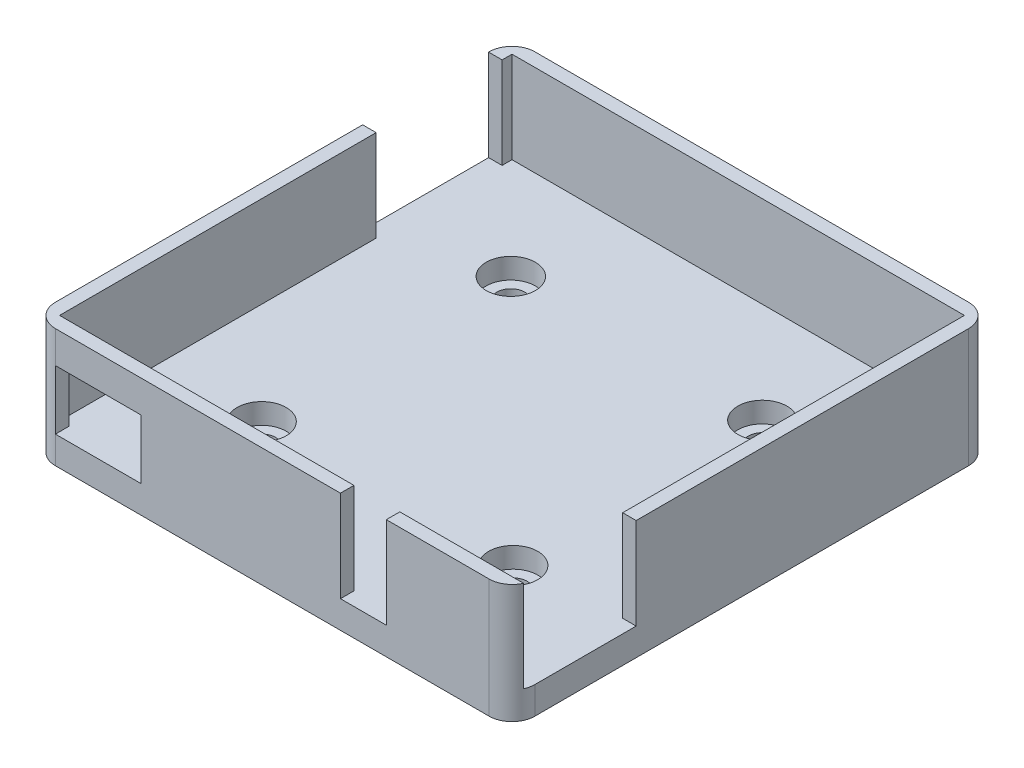
ISO-10303-21;
HEADER;
FILE_DESCRIPTION(('STEP AP214'),'2;1');
FILE_NAME('part.step','',(''),(''),'','','');
FILE_SCHEMA(('AUTOMOTIVE_DESIGN { 1 0 10303 214 1 1 1 1 }'));
ENDSEC;
DATA;
#1=APPLICATION_CONTEXT('core data for automotive mechanical design processes');
#2=APPLICATION_PROTOCOL_DEFINITION('international standard','automotive_design',2000,#1);
#3=PRODUCT_CONTEXT('',#1,'mechanical');
#4=PRODUCT('Part','Part','',(#3));
#5=PRODUCT_RELATED_PRODUCT_CATEGORY('part','',(#4));
#6=PRODUCT_DEFINITION_FORMATION('','',#4);
#7=PRODUCT_DEFINITION_CONTEXT('part definition',#1,'design');
#8=PRODUCT_DEFINITION('design','',#6,#7);
#9=PRODUCT_DEFINITION_SHAPE('','',#8);
#10=(LENGTH_UNIT() NAMED_UNIT(*) SI_UNIT(.MILLI.,.METRE.));
#11=(NAMED_UNIT(*) PLANE_ANGLE_UNIT() SI_UNIT($,.RADIAN.));
#12=(NAMED_UNIT(*) SI_UNIT($,.STERADIAN.) SOLID_ANGLE_UNIT());
#13=UNCERTAINTY_MEASURE_WITH_UNIT(LENGTH_MEASURE(1.E-05),#10,'distance_accuracy_value','');
#14=(GEOMETRIC_REPRESENTATION_CONTEXT(3) GLOBAL_UNCERTAINTY_ASSIGNED_CONTEXT((#13)) GLOBAL_UNIT_ASSIGNED_CONTEXT((#10,
#11,#12)) REPRESENTATION_CONTEXT('',''));
#15=CARTESIAN_POINT('',(0.,0.,0.));
#16=DIRECTION('',(0.,0.,1.));
#17=DIRECTION('',(1.,0.,0.));
#18=AXIS2_PLACEMENT_3D('',#15,#16,#17);
#19=CARTESIAN_POINT('',(0.,11.43,0.));
#20=DIRECTION('',(0.,-1.,0.));
#21=DIRECTION('',(0.,0.,-1.));
#22=AXIS2_PLACEMENT_3D('',#19,#20,#21);
#23=PLANE('',#22);
#24=DIRECTION('',(1.,0.,0.));
#25=VECTOR('',#24,1.);
#26=CARTESIAN_POINT('',(-26.646,11.43,26.646));
#27=LINE('',#26,#25);
#28=CARTESIAN_POINT('',(12.676,11.43,26.646));
#29=VERTEX_POINT('',#28);
#30=CARTESIAN_POINT('',(24.106,11.43,26.646));
#31=VERTEX_POINT('',#30);
#32=EDGE_CURVE('E346',#29,#31,#27,.T.);
#33=ORIENTED_EDGE('',*,*,#32,.T.);
#34=CARTESIAN_POINT('',(24.106,11.43,24.106));
#35=DIRECTION('',(0.,-1.,0.));
#36=DIRECTION('',(0.,0.,-1.));
#37=AXIS2_PLACEMENT_3D('',#34,#35,#36);
#38=CIRCLE('',#37,2.54);
#39=CARTESIAN_POINT('',(26.4233260452513,11.43,25.146));
#40=VERTEX_POINT('',#39);
#41=EDGE_CURVE('E55',#31,#40,#38,.F.);
#42=ORIENTED_EDGE('',*,*,#41,.T.);
#43=DIRECTION('',(1.,0.,0.));
#44=VECTOR('',#43,1.);
#45=CARTESIAN_POINT('',(-25.146,11.43,25.146));
#46=LINE('',#45,#44);
#47=CARTESIAN_POINT('',(12.676,11.43,25.146));
#48=VERTEX_POINT('',#47);
#49=EDGE_CURVE('E329',#48,#40,#46,.T.);
#50=ORIENTED_EDGE('',*,*,#49,.F.);
#51=DIRECTION('',(0.,0.,1.));
#52=VECTOR('',#51,1.);
#53=CARTESIAN_POINT('',(12.676,11.43,16.646));
#54=LINE('',#53,#52);
#55=EDGE_CURVE('E298',#48,#29,#54,.T.);
#56=ORIENTED_EDGE('',*,*,#55,.T.);
#57=EDGE_LOOP('',(#33,#42,#50,#56));
#58=FACE_BOUND('',#57,.T.);
#59=ADVANCED_FACE('F33',(#58),#23,.F.);
#60=DIRECTION('',(0.,0.,1.));
#61=VECTOR('',#60,1.);
#62=CARTESIAN_POINT('',(-26.646,11.43,-26.646));
#63=LINE('',#62,#61);
#64=CARTESIAN_POINT('',(-26.646,11.43,-10.04600006));
#65=VERTEX_POINT('',#64);
#66=CARTESIAN_POINT('',(-26.646,11.43,24.106));
#67=VERTEX_POINT('',#66);
#68=EDGE_CURVE('E343',#65,#67,#63,.T.);
#69=ORIENTED_EDGE('',*,*,#68,.T.);
#70=CARTESIAN_POINT('',(-24.106,11.43,24.106));
#71=DIRECTION('',(0.,-1.,0.));
#72=DIRECTION('',(0.,0.,-1.));
#73=AXIS2_PLACEMENT_3D('',#70,#71,#72);
#74=CIRCLE('',#73,2.54);
#75=CARTESIAN_POINT('',(-24.106,11.43,26.646));
#76=VERTEX_POINT('',#75);
#77=EDGE_CURVE('E401',#67,#76,#74,.F.);
#78=ORIENTED_EDGE('',*,*,#77,.T.);
#79=CARTESIAN_POINT('',(7.576,11.43,26.646));
#80=VERTEX_POINT('',#79);
#81=EDGE_CURVE('E347',#76,#80,#27,.T.);
#82=ORIENTED_EDGE('',*,*,#81,.T.);
#83=DIRECTION('',(0.,0.,1.));
#84=VECTOR('',#83,1.);
#85=CARTESIAN_POINT('',(7.576,11.43,16.646));
#86=LINE('',#85,#84);
#87=CARTESIAN_POINT('',(7.576,11.43,25.146));
#88=VERTEX_POINT('',#87);
#89=EDGE_CURVE('E268',#88,#80,#86,.T.);
#90=ORIENTED_EDGE('',*,*,#89,.F.);
#91=CARTESIAN_POINT('',(-25.146,11.43,25.146));
#92=VERTEX_POINT('',#91);
#93=EDGE_CURVE('E330',#92,#88,#46,.T.);
#94=ORIENTED_EDGE('',*,*,#93,.F.);
#95=DIRECTION('',(0.,0.,1.));
#96=VECTOR('',#95,1.);
#97=CARTESIAN_POINT('',(-25.146,11.43,-25.146));
#98=LINE('',#97,#96);
#99=CARTESIAN_POINT('',(-25.146,11.43,-10.04600006));
#100=VERTEX_POINT('',#99);
#101=EDGE_CURVE('E325',#100,#92,#98,.T.);
#102=ORIENTED_EDGE('',*,*,#101,.F.);
#103=DIRECTION('',(-1.,0.,0.));
#104=VECTOR('',#103,1.);
#105=CARTESIAN_POINT('',(-16.646,11.43,-10.04600006));
#106=LINE('',#105,#104);
#107=EDGE_CURVE('E316',#100,#65,#106,.T.);
#108=ORIENTED_EDGE('',*,*,#107,.T.);
#109=EDGE_LOOP('',(#69,#78,#82,#90,#94,#102,#108));
#110=FACE_BOUND('',#109,.T.);
#111=ADVANCED_FACE('F465',(#110),#23,.F.);
#112=CARTESIAN_POINT('',(-25.146,11.43,25.146));
#113=DIRECTION('',(0.,0.,-1.));
#114=DIRECTION('',(-1.,0.,0.));
#115=AXIS2_PLACEMENT_3D('',#112,#113,#114);
#116=PLANE('',#115);
#117=DIRECTION('',(0.,1.,0.));
#118=VECTOR('',#117,1.);
#119=CARTESIAN_POINT('',(-24.106,11.43,25.146));
#120=LINE('',#119,#118);
#121=CARTESIAN_POINT('',(-24.106,1.27,25.146));
#122=VERTEX_POINT('',#121);
#123=CARTESIAN_POINT('',(-24.106,7.87,25.146));
#124=VERTEX_POINT('',#123);
#125=EDGE_CURVE('E381',#122,#124,#120,.T.);
#126=ORIENTED_EDGE('',*,*,#125,.F.);
#127=DIRECTION('',(1.,0.,0.));
#128=VECTOR('',#127,1.);
#129=CARTESIAN_POINT('',(0.,1.27,25.146));
#130=LINE('',#129,#128);
#131=CARTESIAN_POINT('',(-25.146,1.27,25.146));
#132=VERTEX_POINT('',#131);
#133=EDGE_CURVE('E362',#132,#122,#130,.T.);
#134=ORIENTED_EDGE('',*,*,#133,.F.);
#135=DIRECTION('',(0.,-1.,0.));
#136=VECTOR('',#135,1.);
#137=CARTESIAN_POINT('',(-25.146,11.43,25.146));
#138=LINE('',#137,#136);
#139=EDGE_CURVE('E333',#92,#132,#138,.T.);
#140=ORIENTED_EDGE('',*,*,#139,.F.);
#141=ORIENTED_EDGE('',*,*,#93,.T.);
#142=DIRECTION('',(0.,1.,0.));
#143=VECTOR('',#142,1.);
#144=CARTESIAN_POINT('',(7.576,11.43,25.146));
#145=LINE('',#144,#143);
#146=CARTESIAN_POINT('',(7.576,1.27,25.146));
#147=VERTEX_POINT('',#146);
#148=EDGE_CURVE('E374',#147,#88,#145,.T.);
#149=ORIENTED_EDGE('',*,*,#148,.F.);
#150=CARTESIAN_POINT('',(-14.606,1.27,25.146));
#151=VERTEX_POINT('',#150);
#152=EDGE_CURVE('E366',#151,#147,#130,.T.);
#153=ORIENTED_EDGE('',*,*,#152,.F.);
#154=DIRECTION('',(0.,-1.,0.));
#155=VECTOR('',#154,1.);
#156=CARTESIAN_POINT('',(-14.606,11.43,25.146));
#157=LINE('',#156,#155);
#158=CARTESIAN_POINT('',(-14.606,7.87,25.146));
#159=VERTEX_POINT('',#158);
#160=EDGE_CURVE('E376',#159,#151,#157,.T.);
#161=ORIENTED_EDGE('',*,*,#160,.F.);
#162=DIRECTION('',(1.,0.,0.));
#163=VECTOR('',#162,1.);
#164=CARTESIAN_POINT('',(-25.146,7.87,25.146));
#165=LINE('',#164,#163);
#166=EDGE_CURVE('E379',#124,#159,#165,.T.);
#167=ORIENTED_EDGE('',*,*,#166,.F.);
#168=EDGE_LOOP('',(#126,#134,#140,#141,#149,#153,#161,#167));
#169=FACE_BOUND('',#168,.T.);
#170=ADVANCED_FACE('F470',(#169),#116,.T.);
#171=CARTESIAN_POINT('',(-25.146,11.43,-25.146));
#172=DIRECTION('',(1.,0.,0.));
#173=DIRECTION('',(0.,0.,-1.));
#174=AXIS2_PLACEMENT_3D('',#171,#172,#173);
#175=PLANE('',#174);
#176=DIRECTION('',(0.,1.,0.));
#177=VECTOR('',#176,1.);
#178=CARTESIAN_POINT('',(-25.146,11.43,-24.046));
#179=LINE('',#178,#177);
#180=CARTESIAN_POINT('',(-25.146,1.27,-24.046));
#181=VERTEX_POINT('',#180);
#182=CARTESIAN_POINT('',(-25.146,11.43,-24.046));
#183=VERTEX_POINT('',#182);
#184=EDGE_CURVE('E369',#181,#183,#179,.T.);
#185=ORIENTED_EDGE('',*,*,#184,.F.);
#186=DIRECTION('',(0.,0.,1.));
#187=VECTOR('',#186,1.);
#188=CARTESIAN_POINT('',(-25.146,1.27,0.));
#189=LINE('',#188,#187);
#190=CARTESIAN_POINT('',(-25.146,1.27,-25.146));
#191=VERTEX_POINT('',#190);
#192=EDGE_CURVE('E358',#191,#181,#189,.T.);
#193=ORIENTED_EDGE('',*,*,#192,.F.);
#194=DIRECTION('',(0.,-1.,0.));
#195=VECTOR('',#194,1.);
#196=CARTESIAN_POINT('',(-25.146,11.43,-25.146));
#197=LINE('',#196,#195);
#198=CARTESIAN_POINT('',(-25.146,11.43,-25.146));
#199=VERTEX_POINT('',#198);
#200=EDGE_CURVE('E336',#199,#191,#197,.T.);
#201=ORIENTED_EDGE('',*,*,#200,.F.);
#202=EDGE_CURVE('E326',#199,#183,#98,.T.);
#203=ORIENTED_EDGE('',*,*,#202,.T.);
#204=EDGE_LOOP('',(#185,#193,#201,#203));
#205=FACE_BOUND('',#204,.T.);
#206=ADVANCED_FACE('F441',(#205),#175,.T.);
#207=CARTESIAN_POINT('',(0.,1.27,0.));
#208=DIRECTION('',(0.,1.,0.));
#209=DIRECTION('',(0.,0.,1.));
#210=AXIS2_PLACEMENT_3D('',#207,#208,#209);
#211=PLANE('',#210);
#212=CARTESIAN_POINT('',(-13.8485202030083,1.27,13.9820178182196));
#213=DIRECTION('',(0.,1.,0.));
#214=DIRECTION('',(0.,0.,1.));
#215=AXIS2_PLACEMENT_3D('',#212,#213,#214);
#216=CIRCLE('',#215,2.73050000000001);
#217=CARTESIAN_POINT('',(-13.8485202030083,1.27,16.7125178182196));
#218=VERTEX_POINT('',#217);
#219=EDGE_CURVE('E592',#218,#218,#216,.T.);
#220=ORIENTED_EDGE('',*,*,#219,.F.);
#221=EDGE_LOOP('',(#220));
#222=FACE_BOUND('',#221,.T.);
#223=CARTESIAN_POINT('',(-13.9820178182196,1.27,-13.8485202030091));
#224=DIRECTION('',(0.,1.,0.));
#225=DIRECTION('',(0.,0.,1.));
#226=AXIS2_PLACEMENT_3D('',#223,#224,#225);
#227=CIRCLE('',#226,2.73050000000001);
#228=CARTESIAN_POINT('',(-13.9820178182196,1.27,-11.118020203009));
#229=VERTEX_POINT('',#228);
#230=EDGE_CURVE('E602',#229,#229,#227,.T.);
#231=ORIENTED_EDGE('',*,*,#230,.F.);
#232=EDGE_LOOP('',(#231));
#233=FACE_BOUND('',#232,.T.);
#234=CARTESIAN_POINT('',(13.848520203009,1.27,-13.9820178182204));
#235=DIRECTION('',(0.,1.,0.));
#236=DIRECTION('',(0.,0.,1.));
#237=AXIS2_PLACEMENT_3D('',#234,#235,#236);
#238=CIRCLE('',#237,2.73050000000001);
#239=CARTESIAN_POINT('',(13.848520203009,1.27,-11.2515178182204));
#240=VERTEX_POINT('',#239);
#241=EDGE_CURVE('E614',#240,#240,#238,.T.);
#242=ORIENTED_EDGE('',*,*,#241,.F.);
#243=EDGE_LOOP('',(#242));
#244=FACE_BOUND('',#243,.T.);
#245=CARTESIAN_POINT('',(13.9820178182204,1.27,13.8485202030083));
#246=DIRECTION('',(0.,1.,0.));
#247=DIRECTION('',(0.,0.,1.));
#248=AXIS2_PLACEMENT_3D('',#245,#246,#247);
#249=CIRCLE('',#248,2.73050000000001);
#250=CARTESIAN_POINT('',(13.9820178182204,1.27,16.5790202030083));
#251=VERTEX_POINT('',#250);
#252=EDGE_CURVE('E626',#251,#251,#249,.T.);
#253=ORIENTED_EDGE('',*,*,#252,.F.);
#254=EDGE_LOOP('',(#253));
#255=FACE_BOUND('',#254,.T.);
#256=CARTESIAN_POINT('',(12.676,1.27,25.146));
#257=VERTEX_POINT('',#256);
#258=CARTESIAN_POINT('',(26.4233260452513,1.27,25.146));
#259=VERTEX_POINT('',#258);
#260=EDGE_CURVE('E361',#257,#259,#130,.T.);
#261=ORIENTED_EDGE('',*,*,#260,.T.);
#262=CARTESIAN_POINT('',(24.106,1.27,24.106));
#263=DIRECTION('',(0.,1.,0.));
#264=DIRECTION('',(0.,0.,1.));
#265=AXIS2_PLACEMENT_3D('',#262,#263,#264);
#266=CIRCLE('',#265,2.54);
#267=CARTESIAN_POINT('',(26.646,1.27,24.106));
#268=VERTEX_POINT('',#267);
#269=EDGE_CURVE('E11',#259,#268,#266,.T.);
#270=ORIENTED_EDGE('',*,*,#269,.T.);
#271=DIRECTION('',(0.,0.,-1.));
#272=VECTOR('',#271,1.);
#273=CARTESIAN_POINT('',(26.646,1.27,25.146));
#274=LINE('',#273,#272);
#275=CARTESIAN_POINT('',(26.646,1.27,12.846));
#276=VERTEX_POINT('',#275);
#277=EDGE_CURVE('E254',#268,#276,#274,.T.);
#278=ORIENTED_EDGE('',*,*,#277,.T.);
#279=DIRECTION('',(1.,0.,0.));
#280=VECTOR('',#279,1.);
#281=CARTESIAN_POINT('',(16.646,1.27,12.846));
#282=LINE('',#281,#280);
#283=CARTESIAN_POINT('',(25.146,1.27,12.846));
#284=VERTEX_POINT('',#283);
#285=EDGE_CURVE('E258',#284,#276,#282,.T.);
#286=ORIENTED_EDGE('',*,*,#285,.F.);
#287=DIRECTION('',(0.,0.,1.));
#288=VECTOR('',#287,1.);
#289=CARTESIAN_POINT('',(25.146,1.27,0.));
#290=LINE('',#289,#288);
#291=CARTESIAN_POINT('',(25.146,1.27,-25.146));
#292=VERTEX_POINT('',#291);
#293=EDGE_CURVE('E352',#292,#284,#290,.T.);
#294=ORIENTED_EDGE('',*,*,#293,.F.);
#295=DIRECTION('',(1.,0.,0.));
#296=VECTOR('',#295,1.);
#297=CARTESIAN_POINT('',(0.,1.27,-25.146));
#298=LINE('',#297,#296);
#299=EDGE_CURVE('E355',#191,#292,#298,.T.);
#300=ORIENTED_EDGE('',*,*,#299,.F.);
#301=ORIENTED_EDGE('',*,*,#192,.T.);
#302=DIRECTION('',(-1.,0.,0.));
#303=VECTOR('',#302,1.);
#304=CARTESIAN_POINT('',(-16.646,1.27,-24.046));
#305=LINE('',#304,#303);
#306=CARTESIAN_POINT('',(-26.646,1.27,-24.046));
#307=VERTEX_POINT('',#306);
#308=EDGE_CURVE('E311',#181,#307,#305,.T.);
#309=ORIENTED_EDGE('',*,*,#308,.T.);
#310=DIRECTION('',(0.,0.,1.));
#311=VECTOR('',#310,1.);
#312=CARTESIAN_POINT('',(-26.646,1.27,-24.046));
#313=LINE('',#312,#311);
#314=CARTESIAN_POINT('',(-26.646,1.27,-10.04600006));
#315=VERTEX_POINT('',#314);
#316=EDGE_CURVE('E306',#307,#315,#313,.T.);
#317=ORIENTED_EDGE('',*,*,#316,.T.);
#318=DIRECTION('',(-1.,0.,0.));
#319=VECTOR('',#318,1.);
#320=CARTESIAN_POINT('',(-16.646,1.27,-10.04600006));
#321=LINE('',#320,#319);
#322=CARTESIAN_POINT('',(-25.146,1.27,-10.04600006));
#323=VERTEX_POINT('',#322);
#324=EDGE_CURVE('E319',#323,#315,#321,.T.);
#325=ORIENTED_EDGE('',*,*,#324,.F.);
#326=EDGE_CURVE('E357',#323,#132,#189,.T.);
#327=ORIENTED_EDGE('',*,*,#326,.T.);
#328=ORIENTED_EDGE('',*,*,#133,.T.);
#329=DIRECTION('',(0.,0.,1.));
#330=VECTOR('',#329,1.);
#331=CARTESIAN_POINT('',(-24.106,1.27,16.646));
#332=LINE('',#331,#330);
#333=CARTESIAN_POINT('',(-24.106,1.27,26.646));
#334=VERTEX_POINT('',#333);
#335=EDGE_CURVE('E277',#122,#334,#332,.T.);
#336=ORIENTED_EDGE('',*,*,#335,.T.);
#337=DIRECTION('',(1.,0.,0.));
#338=VECTOR('',#337,1.);
#339=CARTESIAN_POINT('',(-24.106,1.27,26.646));
#340=LINE('',#339,#338);
#341=CARTESIAN_POINT('',(-14.606,1.27,26.646));
#342=VERTEX_POINT('',#341);
#343=EDGE_CURVE('E267',#334,#342,#340,.T.);
#344=ORIENTED_EDGE('',*,*,#343,.T.);
#345=DIRECTION('',(0.,0.,1.));
#346=VECTOR('',#345,1.);
#347=CARTESIAN_POINT('',(-14.606,1.27,16.646));
#348=LINE('',#347,#346);
#349=EDGE_CURVE('E284',#151,#342,#348,.T.);
#350=ORIENTED_EDGE('',*,*,#349,.F.);
#351=ORIENTED_EDGE('',*,*,#152,.T.);
#352=DIRECTION('',(0.,0.,1.));
#353=VECTOR('',#352,1.);
#354=CARTESIAN_POINT('',(7.576,1.27,16.646));
#355=LINE('',#354,#353);
#356=CARTESIAN_POINT('',(7.576,1.27,26.646));
#357=VERTEX_POINT('',#356);
#358=EDGE_CURVE('E295',#147,#357,#355,.T.);
#359=ORIENTED_EDGE('',*,*,#358,.T.);
#360=DIRECTION('',(1.,0.,0.));
#361=VECTOR('',#360,1.);
#362=CARTESIAN_POINT('',(7.576,1.27,26.646));
#363=LINE('',#362,#361);
#364=CARTESIAN_POINT('',(12.676,1.27,26.646));
#365=VERTEX_POINT('',#364);
#366=EDGE_CURVE('E290',#357,#365,#363,.T.);
#367=ORIENTED_EDGE('',*,*,#366,.T.);
#368=DIRECTION('',(0.,0.,1.));
#369=VECTOR('',#368,1.);
#370=CARTESIAN_POINT('',(12.676,1.27,16.646));
#371=LINE('',#370,#369);
#372=EDGE_CURVE('E301',#257,#365,#371,.T.);
#373=ORIENTED_EDGE('',*,*,#372,.F.);
#374=EDGE_LOOP('',(#261,#270,#278,#286,#294,#300,#301,#309,#317,#325,#327,#328,#336,#344,#350,
#351,#359,#367,#373));
#375=FACE_BOUND('',#374,.T.);
#376=ADVANCED_FACE('F418',(#222,#233,#244,#255,#375),#211,.T.);
#377=DIRECTION('',(-1.,0.,0.));
#378=VECTOR('',#377,1.);
#379=CARTESIAN_POINT('',(-26.646,11.43,-26.646));
#380=LINE('',#379,#378);
#381=CARTESIAN_POINT('',(24.106,11.43,-26.646));
#382=VERTEX_POINT('',#381);
#383=CARTESIAN_POINT('',(-24.106,11.43,-26.646));
#384=VERTEX_POINT('',#383);
#385=EDGE_CURVE('E213',#382,#384,#380,.T.);
#386=ORIENTED_EDGE('',*,*,#385,.T.);
#387=CARTESIAN_POINT('',(-24.106,11.43,-24.106));
#388=DIRECTION('',(0.,-1.,0.));
#389=DIRECTION('',(0.,0.,-1.));
#390=AXIS2_PLACEMENT_3D('',#387,#388,#389);
#391=CIRCLE('',#390,2.54);
#392=CARTESIAN_POINT('',(-26.646,11.43,-24.106));
#393=VERTEX_POINT('',#392);
#394=EDGE_CURVE('E392',#384,#393,#391,.F.);
#395=ORIENTED_EDGE('',*,*,#394,.T.);
#396=CARTESIAN_POINT('',(-26.646,11.43,-24.046));
#397=VERTEX_POINT('',#396);
#398=EDGE_CURVE('E344',#393,#397,#63,.T.);
#399=ORIENTED_EDGE('',*,*,#398,.T.);
#400=DIRECTION('',(-1.,0.,0.));
#401=VECTOR('',#400,1.);
#402=CARTESIAN_POINT('',(-16.646,11.43,-24.046));
#403=LINE('',#402,#401);
#404=EDGE_CURVE('E312',#183,#397,#403,.T.);
#405=ORIENTED_EDGE('',*,*,#404,.F.);
#406=ORIENTED_EDGE('',*,*,#202,.F.);
#407=DIRECTION('',(-1.,0.,0.));
#408=VECTOR('',#407,1.);
#409=CARTESIAN_POINT('',(-25.146,11.43,-25.146));
#410=LINE('',#409,#408);
#411=CARTESIAN_POINT('',(25.146,11.43,-25.146));
#412=VERTEX_POINT('',#411);
#413=EDGE_CURVE('E323',#412,#199,#410,.T.);
#414=ORIENTED_EDGE('',*,*,#413,.F.);
#415=DIRECTION('',(0.,0.,-1.));
#416=VECTOR('',#415,1.);
#417=CARTESIAN_POINT('',(25.146,11.43,-25.146));
#418=LINE('',#417,#416);
#419=CARTESIAN_POINT('',(25.146,11.43,12.846));
#420=VERTEX_POINT('',#419);
#421=EDGE_CURVE('E315',#420,#412,#418,.T.);
#422=ORIENTED_EDGE('',*,*,#421,.F.);
#423=DIRECTION('',(1.,0.,0.));
#424=VECTOR('',#423,1.);
#425=CARTESIAN_POINT('',(16.646,11.43,12.846));
#426=LINE('',#425,#424);
#427=CARTESIAN_POINT('',(26.646,11.43,12.846));
#428=VERTEX_POINT('',#427);
#429=EDGE_CURVE('E259',#420,#428,#426,.T.);
#430=ORIENTED_EDGE('',*,*,#429,.T.);
#431=DIRECTION('',(0.,0.,-1.));
#432=VECTOR('',#431,1.);
#433=CARTESIAN_POINT('',(26.646,11.43,-26.646));
#434=LINE('',#433,#432);
#435=CARTESIAN_POINT('',(26.646,11.43,-24.106));
#436=VERTEX_POINT('',#435);
#437=EDGE_CURVE('E349',#428,#436,#434,.T.);
#438=ORIENTED_EDGE('',*,*,#437,.T.);
#439=CARTESIAN_POINT('',(24.106,11.43,-24.106));
#440=DIRECTION('',(0.,-1.,0.));
#441=DIRECTION('',(0.,0.,-1.));
#442=AXIS2_PLACEMENT_3D('',#439,#440,#441);
#443=CIRCLE('',#442,2.54);
#444=EDGE_CURVE('E386',#436,#382,#443,.F.);
#445=ORIENTED_EDGE('',*,*,#444,.T.);
#446=EDGE_LOOP('',(#386,#395,#399,#405,#406,#414,#422,#430,#438,#445));
#447=FACE_BOUND('',#446,.T.);
#448=ADVANCED_FACE('F428',(#447),#23,.F.);
#449=CARTESIAN_POINT('',(-26.646,11.43,-26.646));
#450=DIRECTION('',(0.,0.,1.));
#451=DIRECTION('',(1.,0.,0.));
#452=AXIS2_PLACEMENT_3D('',#449,#450,#451);
#453=PLANE('',#452);
#454=DIRECTION('',(0.,-1.,0.));
#455=VECTOR('',#454,1.);
#456=CARTESIAN_POINT('',(24.106,11.43,-26.646));
#457=LINE('',#456,#455);
#458=CARTESIAN_POINT('',(24.106,-1.778,-26.646));
#459=VERTEX_POINT('',#458);
#460=EDGE_CURVE('E208',#382,#459,#457,.T.);
#461=ORIENTED_EDGE('',*,*,#460,.T.);
#462=DIRECTION('',(-1.,0.,0.));
#463=VECTOR('',#462,1.);
#464=CARTESIAN_POINT('',(24.106,-1.778,-26.646));
#465=LINE('',#464,#463);
#466=CARTESIAN_POINT('',(-24.106,-1.778,-26.646));
#467=VERTEX_POINT('',#466);
#468=EDGE_CURVE('E211',#459,#467,#465,.T.);
#469=ORIENTED_EDGE('',*,*,#468,.T.);
#470=DIRECTION('',(0.,-1.,0.));
#471=VECTOR('',#470,1.);
#472=CARTESIAN_POINT('',(-24.106,11.43,-26.646));
#473=LINE('',#472,#471);
#474=EDGE_CURVE('E390',#467,#384,#473,.F.);
#475=ORIENTED_EDGE('',*,*,#474,.T.);
#476=ORIENTED_EDGE('',*,*,#385,.F.);
#477=EDGE_LOOP('',(#461,#469,#475,#476));
#478=FACE_BOUND('',#477,.T.);
#479=ADVANCED_FACE('F210',(#478),#453,.F.);
#480=CARTESIAN_POINT('',(-26.646,11.43,-26.646));
#481=DIRECTION('',(1.,0.,0.));
#482=DIRECTION('',(0.,0.,-1.));
#483=AXIS2_PLACEMENT_3D('',#480,#481,#482);
#484=PLANE('',#483);
#485=DIRECTION('',(0.,1.,0.));
#486=VECTOR('',#485,1.);
#487=CARTESIAN_POINT('',(-26.646,1.27,-10.04600006));
#488=LINE('',#487,#486);
#489=EDGE_CURVE('E309',#315,#65,#488,.T.);
#490=ORIENTED_EDGE('',*,*,#489,.F.);
#491=ORIENTED_EDGE('',*,*,#316,.F.);
#492=DIRECTION('',(0.,-1.,0.));
#493=VECTOR('',#492,1.);
#494=CARTESIAN_POINT('',(-26.646,1.27,-24.046));
#495=LINE('',#494,#493);
#496=EDGE_CURVE('E281',#397,#307,#495,.T.);
#497=ORIENTED_EDGE('',*,*,#496,.F.);
#498=ORIENTED_EDGE('',*,*,#398,.F.);
#499=DIRECTION('',(0.,-1.,0.));
#500=VECTOR('',#499,1.);
#501=CARTESIAN_POINT('',(-26.646,11.43,-24.106));
#502=LINE('',#501,#500);
#503=CARTESIAN_POINT('',(-26.646,-1.778,-24.106));
#504=VERTEX_POINT('',#503);
#505=EDGE_CURVE('E388',#393,#504,#502,.T.);
#506=ORIENTED_EDGE('',*,*,#505,.T.);
#507=DIRECTION('',(0.,0.,1.));
#508=VECTOR('',#507,1.);
#509=CARTESIAN_POINT('',(-26.646,-1.778,-24.106));
#510=LINE('',#509,#508);
#511=CARTESIAN_POINT('',(-26.646,-1.778,24.106));
#512=VERTEX_POINT('',#511);
#513=EDGE_CURVE('E240',#504,#512,#510,.T.);
#514=ORIENTED_EDGE('',*,*,#513,.T.);
#515=DIRECTION('',(0.,-1.,0.));
#516=VECTOR('',#515,1.);
#517=CARTESIAN_POINT('',(-26.646,11.43,24.106));
#518=LINE('',#517,#516);
#519=EDGE_CURVE('E399',#512,#67,#518,.F.);
#520=ORIENTED_EDGE('',*,*,#519,.T.);
#521=ORIENTED_EDGE('',*,*,#68,.F.);
#522=EDGE_LOOP('',(#490,#491,#497,#498,#506,#514,#520,#521));
#523=FACE_BOUND('',#522,.T.);
#524=ADVANCED_FACE('F451',(#523),#484,.F.);
#525=CARTESIAN_POINT('',(-26.646,11.43,26.646));
#526=DIRECTION('',(0.,0.,-1.));
#527=DIRECTION('',(-1.,0.,0.));
#528=AXIS2_PLACEMENT_3D('',#525,#526,#527);
#529=PLANE('',#528);
#530=DIRECTION('',(0.,1.,0.));
#531=VECTOR('',#530,1.);
#532=CARTESIAN_POINT('',(12.676,1.27,26.646));
#533=LINE('',#532,#531);
#534=EDGE_CURVE('E293',#365,#29,#533,.T.);
#535=ORIENTED_EDGE('',*,*,#534,.F.);
#536=ORIENTED_EDGE('',*,*,#366,.F.);
#537=DIRECTION('',(0.,-1.,0.));
#538=VECTOR('',#537,1.);
#539=CARTESIAN_POINT('',(7.576,1.27,26.646));
#540=LINE('',#539,#538);
#541=EDGE_CURVE('E262',#80,#357,#540,.T.);
#542=ORIENTED_EDGE('',*,*,#541,.F.);
#543=ORIENTED_EDGE('',*,*,#81,.F.);
#544=DIRECTION('',(0.,-1.,0.));
#545=VECTOR('',#544,1.);
#546=CARTESIAN_POINT('',(-24.106,11.43,26.646));
#547=LINE('',#546,#545);
#548=CARTESIAN_POINT('',(-24.106,7.87,26.646));
#549=VERTEX_POINT('',#548);
#550=EDGE_CURVE('E396',#76,#549,#547,.T.);
#551=ORIENTED_EDGE('',*,*,#550,.T.);
#552=DIRECTION('',(-1.,0.,0.));
#553=VECTOR('',#552,1.);
#554=CARTESIAN_POINT('',(-24.106,7.87,26.646));
#555=LINE('',#554,#553);
#556=CARTESIAN_POINT('',(-14.606,7.87,26.646));
#557=VERTEX_POINT('',#556);
#558=EDGE_CURVE('E274',#557,#549,#555,.T.);
#559=ORIENTED_EDGE('',*,*,#558,.F.);
#560=DIRECTION('',(0.,1.,0.));
#561=VECTOR('',#560,1.);
#562=CARTESIAN_POINT('',(-14.606,1.27,26.646));
#563=LINE('',#562,#561);
#564=EDGE_CURVE('E271',#342,#557,#563,.T.);
#565=ORIENTED_EDGE('',*,*,#564,.F.);
#566=ORIENTED_EDGE('',*,*,#343,.F.);
#567=DIRECTION('',(0.,-1.,0.));
#568=VECTOR('',#567,1.);
#569=CARTESIAN_POINT('',(-24.106,11.43,26.646));
#570=LINE('',#569,#568);
#571=CARTESIAN_POINT('',(-24.106,-1.778,26.646));
#572=VERTEX_POINT('',#571);
#573=EDGE_CURVE('E394',#334,#572,#570,.T.);
#574=ORIENTED_EDGE('',*,*,#573,.T.);
#575=DIRECTION('',(1.,0.,0.));
#576=VECTOR('',#575,1.);
#577=CARTESIAN_POINT('',(-24.106,-1.778,26.646));
#578=LINE('',#577,#576);
#579=CARTESIAN_POINT('',(24.106,-1.778,26.646));
#580=VERTEX_POINT('',#579);
#581=EDGE_CURVE('E246',#572,#580,#578,.T.);
#582=ORIENTED_EDGE('',*,*,#581,.T.);
#583=DIRECTION('',(0.,-1.,0.));
#584=VECTOR('',#583,1.);
#585=CARTESIAN_POINT('',(24.106,11.43,26.646));
#586=LINE('',#585,#584);
#587=EDGE_CURVE('E405',#580,#31,#586,.F.);
#588=ORIENTED_EDGE('',*,*,#587,.T.);
#589=ORIENTED_EDGE('',*,*,#32,.F.);
#590=EDGE_LOOP('',(#535,#536,#542,#543,#551,#559,#565,#566,#574,#582,#588,#589));
#591=FACE_BOUND('',#590,.T.);
#592=ADVANCED_FACE('F410',(#591),#529,.F.);
#593=CARTESIAN_POINT('',(26.646,11.43,-26.646));
#594=DIRECTION('',(-1.,0.,0.));
#595=DIRECTION('',(0.,0.,1.));
#596=AXIS2_PLACEMENT_3D('',#593,#594,#595);
#597=PLANE('',#596);
#598=DIRECTION('',(0.,1.,0.));
#599=VECTOR('',#598,1.);
#600=CARTESIAN_POINT('',(26.646,1.27,12.846));
#601=LINE('',#600,#599);
#602=EDGE_CURVE('E256',#276,#428,#601,.T.);
#603=ORIENTED_EDGE('',*,*,#602,.F.);
#604=ORIENTED_EDGE('',*,*,#277,.F.);
#605=DIRECTION('',(0.,-1.,0.));
#606=VECTOR('',#605,1.);
#607=CARTESIAN_POINT('',(26.646,11.43,24.106));
#608=LINE('',#607,#606);
#609=CARTESIAN_POINT('',(26.646,-1.778,24.106));
#610=VERTEX_POINT('',#609);
#611=EDGE_CURVE('E403',#268,#610,#608,.T.);
#612=ORIENTED_EDGE('',*,*,#611,.T.);
#613=DIRECTION('',(0.,0.,-1.));
#614=VECTOR('',#613,1.);
#615=CARTESIAN_POINT('',(26.646,-1.778,24.106));
#616=LINE('',#615,#614);
#617=CARTESIAN_POINT('',(26.646,-1.778,-24.106));
#618=VERTEX_POINT('',#617);
#619=EDGE_CURVE('E252',#610,#618,#616,.T.);
#620=ORIENTED_EDGE('',*,*,#619,.T.);
#621=DIRECTION('',(0.,-1.,0.));
#622=VECTOR('',#621,1.);
#623=CARTESIAN_POINT('',(26.646,11.43,-24.106));
#624=LINE('',#623,#622);
#625=EDGE_CURVE('E217',#618,#436,#624,.F.);
#626=ORIENTED_EDGE('',*,*,#625,.T.);
#627=ORIENTED_EDGE('',*,*,#437,.F.);
#628=EDGE_LOOP('',(#603,#604,#612,#620,#626,#627));
#629=FACE_BOUND('',#628,.T.);
#630=ADVANCED_FACE('F421',(#629),#597,.F.);
#631=CARTESIAN_POINT('',(25.146,11.43,-25.146));
#632=DIRECTION('',(-1.,0.,0.));
#633=DIRECTION('',(0.,0.,1.));
#634=AXIS2_PLACEMENT_3D('',#631,#632,#633);
#635=PLANE('',#634);
#636=DIRECTION('',(0.,-1.,0.));
#637=VECTOR('',#636,1.);
#638=CARTESIAN_POINT('',(25.146,11.43,12.846));
#639=LINE('',#638,#637);
#640=EDGE_CURVE('E218',#420,#284,#639,.T.);
#641=ORIENTED_EDGE('',*,*,#640,.F.);
#642=ORIENTED_EDGE('',*,*,#421,.T.);
#643=DIRECTION('',(0.,-1.,0.));
#644=VECTOR('',#643,1.);
#645=CARTESIAN_POINT('',(25.146,11.43,-25.146));
#646=LINE('',#645,#644);
#647=EDGE_CURVE('E339',#412,#292,#646,.T.);
#648=ORIENTED_EDGE('',*,*,#647,.T.);
#649=ORIENTED_EDGE('',*,*,#293,.T.);
#650=EDGE_LOOP('',(#641,#642,#648,#649));
#651=FACE_BOUND('',#650,.T.);
#652=ADVANCED_FACE('F433',(#651),#635,.T.);
#653=CARTESIAN_POINT('',(-25.146,11.43,-25.146));
#654=DIRECTION('',(0.,0.,1.));
#655=DIRECTION('',(1.,0.,0.));
#656=AXIS2_PLACEMENT_3D('',#653,#654,#655);
#657=PLANE('',#656);
#658=ORIENTED_EDGE('',*,*,#200,.T.);
#659=ORIENTED_EDGE('',*,*,#299,.T.);
#660=ORIENTED_EDGE('',*,*,#647,.F.);
#661=ORIENTED_EDGE('',*,*,#413,.T.);
#662=EDGE_LOOP('',(#658,#659,#660,#661));
#663=FACE_BOUND('',#662,.T.);
#664=ADVANCED_FACE('F436',(#663),#657,.T.);
#665=DIRECTION('',(0.,-1.,0.));
#666=VECTOR('',#665,1.);
#667=CARTESIAN_POINT('',(-25.146,11.43,-10.04600006));
#668=LINE('',#667,#666);
#669=EDGE_CURVE('E365',#100,#323,#668,.T.);
#670=ORIENTED_EDGE('',*,*,#669,.F.);
#671=ORIENTED_EDGE('',*,*,#101,.T.);
#672=ORIENTED_EDGE('',*,*,#139,.T.);
#673=ORIENTED_EDGE('',*,*,#326,.F.);
#674=EDGE_LOOP('',(#670,#671,#672,#673));
#675=FACE_BOUND('',#674,.T.);
#676=ADVANCED_FACE('F486',(#675),#175,.T.);
#677=ORIENTED_EDGE('',*,*,#49,.T.);
#678=DIRECTION('',(0.,-1.,0.));
#679=VECTOR('',#678,1.);
#680=CARTESIAN_POINT('',(26.4233260452513,11.43,25.146));
#681=LINE('',#680,#679);
#682=EDGE_CURVE('E41',#40,#259,#681,.T.);
#683=ORIENTED_EDGE('',*,*,#682,.T.);
#684=ORIENTED_EDGE('',*,*,#260,.F.);
#685=DIRECTION('',(0.,-1.,0.));
#686=VECTOR('',#685,1.);
#687=CARTESIAN_POINT('',(12.676,11.43,25.146));
#688=LINE('',#687,#686);
#689=EDGE_CURVE('E371',#48,#257,#688,.T.);
#690=ORIENTED_EDGE('',*,*,#689,.F.);
#691=EDGE_LOOP('',(#677,#683,#684,#690));
#692=FACE_BOUND('',#691,.T.);
#693=ADVANCED_FACE('F503',(#692),#116,.T.);
#694=CARTESIAN_POINT('',(-16.646,1.27,-24.046));
#695=DIRECTION('',(0.,0.,-1.));
#696=DIRECTION('',(-1.,0.,0.));
#697=AXIS2_PLACEMENT_3D('',#694,#695,#696);
#698=PLANE('',#697);
#699=ORIENTED_EDGE('',*,*,#184,.T.);
#700=ORIENTED_EDGE('',*,*,#404,.T.);
#701=ORIENTED_EDGE('',*,*,#496,.T.);
#702=ORIENTED_EDGE('',*,*,#308,.F.);
#703=EDGE_LOOP('',(#699,#700,#701,#702));
#704=FACE_BOUND('',#703,.T.);
#705=ADVANCED_FACE('F444',(#704),#698,.F.);
#706=CARTESIAN_POINT('',(-16.646,1.27,-10.04600006));
#707=DIRECTION('',(0.,0.,1.));
#708=DIRECTION('',(0.,-1.,0.));
#709=AXIS2_PLACEMENT_3D('',#706,#707,#708);
#710=PLANE('',#709);
#711=ORIENTED_EDGE('',*,*,#669,.T.);
#712=ORIENTED_EDGE('',*,*,#324,.T.);
#713=ORIENTED_EDGE('',*,*,#489,.T.);
#714=ORIENTED_EDGE('',*,*,#107,.F.);
#715=EDGE_LOOP('',(#711,#712,#713,#714));
#716=FACE_BOUND('',#715,.T.);
#717=ADVANCED_FACE('F509',(#716),#710,.F.);
#718=CARTESIAN_POINT('',(7.576,1.27,16.646));
#719=DIRECTION('',(-1.,0.,0.));
#720=DIRECTION('',(0.,0.,1.));
#721=AXIS2_PLACEMENT_3D('',#718,#719,#720);
#722=PLANE('',#721);
#723=ORIENTED_EDGE('',*,*,#148,.T.);
#724=ORIENTED_EDGE('',*,*,#89,.T.);
#725=ORIENTED_EDGE('',*,*,#541,.T.);
#726=ORIENTED_EDGE('',*,*,#358,.F.);
#727=EDGE_LOOP('',(#723,#724,#725,#726));
#728=FACE_BOUND('',#727,.T.);
#729=ADVANCED_FACE('F512',(#728),#722,.F.);
#730=CARTESIAN_POINT('',(12.676,1.27,16.646));
#731=DIRECTION('',(1.,0.,0.));
#732=DIRECTION('',(0.,1.,0.));
#733=AXIS2_PLACEMENT_3D('',#730,#731,#732);
#734=PLANE('',#733);
#735=ORIENTED_EDGE('',*,*,#689,.T.);
#736=ORIENTED_EDGE('',*,*,#372,.T.);
#737=ORIENTED_EDGE('',*,*,#534,.T.);
#738=ORIENTED_EDGE('',*,*,#55,.F.);
#739=EDGE_LOOP('',(#735,#736,#737,#738));
#740=FACE_BOUND('',#739,.T.);
#741=ADVANCED_FACE('F516',(#740),#734,.F.);
#742=CARTESIAN_POINT('',(-24.106,1.27,16.646));
#743=DIRECTION('',(-1.,0.,0.));
#744=DIRECTION('',(0.,0.,1.));
#745=AXIS2_PLACEMENT_3D('',#742,#743,#744);
#746=PLANE('',#745);
#747=ORIENTED_EDGE('',*,*,#125,.T.);
#748=DIRECTION('',(0.,0.,1.));
#749=VECTOR('',#748,1.);
#750=CARTESIAN_POINT('',(-24.106,7.87,16.646));
#751=LINE('',#750,#749);
#752=EDGE_CURVE('E278',#124,#549,#751,.T.);
#753=ORIENTED_EDGE('',*,*,#752,.T.);
#754=DIRECTION('',(0.,-1.,0.));
#755=VECTOR('',#754,1.);
#756=CARTESIAN_POINT('',(-24.106,1.27,26.646));
#757=LINE('',#756,#755);
#758=EDGE_CURVE('E265',#549,#334,#757,.T.);
#759=ORIENTED_EDGE('',*,*,#758,.T.);
#760=ORIENTED_EDGE('',*,*,#335,.F.);
#761=EDGE_LOOP('',(#747,#753,#759,#760));
#762=FACE_BOUND('',#761,.T.);
#763=ADVANCED_FACE('F520',(#762),#746,.F.);
#764=CARTESIAN_POINT('',(-24.106,7.87,16.646));
#765=DIRECTION('',(0.,1.,0.));
#766=DIRECTION('',(0.,0.,1.));
#767=AXIS2_PLACEMENT_3D('',#764,#765,#766);
#768=PLANE('',#767);
#769=ORIENTED_EDGE('',*,*,#166,.T.);
#770=DIRECTION('',(0.,0.,1.));
#771=VECTOR('',#770,1.);
#772=CARTESIAN_POINT('',(-14.606,7.87,16.646));
#773=LINE('',#772,#771);
#774=EDGE_CURVE('E282',#159,#557,#773,.T.);
#775=ORIENTED_EDGE('',*,*,#774,.T.);
#776=ORIENTED_EDGE('',*,*,#558,.T.);
#777=ORIENTED_EDGE('',*,*,#752,.F.);
#778=EDGE_LOOP('',(#769,#775,#776,#777));
#779=FACE_BOUND('',#778,.T.);
#780=ADVANCED_FACE('F524',(#779),#768,.F.);
#781=CARTESIAN_POINT('',(-14.606,1.27,16.646));
#782=DIRECTION('',(1.,0.,0.));
#783=DIRECTION('',(0.,0.,-1.));
#784=AXIS2_PLACEMENT_3D('',#781,#782,#783);
#785=PLANE('',#784);
#786=ORIENTED_EDGE('',*,*,#160,.T.);
#787=ORIENTED_EDGE('',*,*,#349,.T.);
#788=ORIENTED_EDGE('',*,*,#564,.T.);
#789=ORIENTED_EDGE('',*,*,#774,.F.);
#790=EDGE_LOOP('',(#786,#787,#788,#789));
#791=FACE_BOUND('',#790,.T.);
#792=ADVANCED_FACE('F526',(#791),#785,.F.);
#793=CARTESIAN_POINT('',(16.646,1.27,12.846));
#794=DIRECTION('',(0.,0.,-1.));
#795=DIRECTION('',(-1.,0.,0.));
#796=AXIS2_PLACEMENT_3D('',#793,#794,#795);
#797=PLANE('',#796);
#798=ORIENTED_EDGE('',*,*,#640,.T.);
#799=ORIENTED_EDGE('',*,*,#285,.T.);
#800=ORIENTED_EDGE('',*,*,#602,.T.);
#801=ORIENTED_EDGE('',*,*,#429,.F.);
#802=EDGE_LOOP('',(#798,#799,#800,#801));
#803=FACE_BOUND('',#802,.T.);
#804=ADVANCED_FACE('F424',(#803),#797,.F.);
#805=CARTESIAN_POINT('',(24.106,11.43,-24.106));
#806=DIRECTION('',(0.,-1.,0.));
#807=DIRECTION('',(0.,0.,-1.));
#808=AXIS2_PLACEMENT_3D('',#805,#806,#807);
#809=CYLINDRICAL_SURFACE('',#808,2.54);
#810=ORIENTED_EDGE('',*,*,#444,.F.);
#811=ORIENTED_EDGE('',*,*,#625,.F.);
#812=CARTESIAN_POINT('',(24.106,-1.778,-24.106));
#813=DIRECTION('',(0.,1.,0.));
#814=DIRECTION('',(0.,0.,1.));
#815=AXIS2_PLACEMENT_3D('',#812,#813,#814);
#816=CIRCLE('',#815,2.54);
#817=EDGE_CURVE('E225',#618,#459,#816,.T.);
#818=ORIENTED_EDGE('',*,*,#817,.T.);
#819=ORIENTED_EDGE('',*,*,#460,.F.);
#820=EDGE_LOOP('',(#810,#811,#818,#819));
#821=FACE_BOUND('',#820,.T.);
#822=ADVANCED_FACE('F231',(#821),#809,.T.);
#823=CARTESIAN_POINT('',(-24.106,11.43,-24.106));
#824=DIRECTION('',(0.,-1.,0.));
#825=DIRECTION('',(0.,0.,-1.));
#826=AXIS2_PLACEMENT_3D('',#823,#824,#825);
#827=CYLINDRICAL_SURFACE('',#826,2.54);
#828=ORIENTED_EDGE('',*,*,#394,.F.);
#829=ORIENTED_EDGE('',*,*,#474,.F.);
#830=CARTESIAN_POINT('',(-24.106,-1.778,-24.106));
#831=DIRECTION('',(0.,1.,0.));
#832=DIRECTION('',(0.,0.,1.));
#833=AXIS2_PLACEMENT_3D('',#830,#831,#832);
#834=CIRCLE('',#833,2.54);
#835=EDGE_CURVE('E229',#467,#504,#834,.T.);
#836=ORIENTED_EDGE('',*,*,#835,.T.);
#837=ORIENTED_EDGE('',*,*,#505,.F.);
#838=EDGE_LOOP('',(#828,#829,#836,#837));
#839=FACE_BOUND('',#838,.T.);
#840=ADVANCED_FACE('F454',(#839),#827,.T.);
#841=CARTESIAN_POINT('',(-24.106,11.43,24.106));
#842=DIRECTION('',(0.,-1.,0.));
#843=DIRECTION('',(0.,0.,-1.));
#844=AXIS2_PLACEMENT_3D('',#841,#842,#843);
#845=CYLINDRICAL_SURFACE('',#844,2.54);
#846=ORIENTED_EDGE('',*,*,#77,.F.);
#847=ORIENTED_EDGE('',*,*,#519,.F.);
#848=CARTESIAN_POINT('',(-24.106,-1.778,24.106));
#849=DIRECTION('',(0.,1.,0.));
#850=DIRECTION('',(0.,0.,1.));
#851=AXIS2_PLACEMENT_3D('',#848,#849,#850);
#852=CIRCLE('',#851,2.54);
#853=EDGE_CURVE('E243',#512,#572,#852,.T.);
#854=ORIENTED_EDGE('',*,*,#853,.T.);
#855=ORIENTED_EDGE('',*,*,#573,.F.);
#856=ORIENTED_EDGE('',*,*,#758,.F.);
#857=ORIENTED_EDGE('',*,*,#550,.F.);
#858=EDGE_LOOP('',(#846,#847,#854,#855,#856,#857));
#859=FACE_BOUND('',#858,.T.);
#860=ADVANCED_FACE('F456',(#859),#845,.T.);
#861=CARTESIAN_POINT('',(24.106,11.43,24.106));
#862=DIRECTION('',(0.,-1.,0.));
#863=DIRECTION('',(0.,0.,-1.));
#864=AXIS2_PLACEMENT_3D('',#861,#862,#863);
#865=CYLINDRICAL_SURFACE('',#864,2.54);
#866=ORIENTED_EDGE('',*,*,#41,.F.);
#867=ORIENTED_EDGE('',*,*,#587,.F.);
#868=CARTESIAN_POINT('',(24.106,-1.778,24.106));
#869=DIRECTION('',(0.,1.,0.));
#870=DIRECTION('',(0.,0.,1.));
#871=AXIS2_PLACEMENT_3D('',#868,#869,#870);
#872=CIRCLE('',#871,2.54);
#873=EDGE_CURVE('E249',#580,#610,#872,.T.);
#874=ORIENTED_EDGE('',*,*,#873,.T.);
#875=ORIENTED_EDGE('',*,*,#611,.F.);
#876=ORIENTED_EDGE('',*,*,#269,.F.);
#877=ORIENTED_EDGE('',*,*,#682,.F.);
#878=EDGE_LOOP('',(#866,#867,#874,#875,#876,#877));
#879=FACE_BOUND('',#878,.T.);
#880=ADVANCED_FACE('F35',(#879),#865,.T.);
#881=CARTESIAN_POINT('',(24.106,-1.778,-24.106));
#882=DIRECTION('',(0.,1.,0.));
#883=DIRECTION('',(0.,0.,1.));
#884=AXIS2_PLACEMENT_3D('',#881,#882,#883);
#885=PLANE('',#884);
#886=CARTESIAN_POINT('',(-13.8485202030083,-1.778,13.9820178182196));
#887=DIRECTION('',(0.,1.,0.));
#888=DIRECTION('',(0.,0.,1.));
#889=AXIS2_PLACEMENT_3D('',#886,#887,#888);
#890=CIRCLE('',#889,1.54940000000001);
#891=CARTESIAN_POINT('',(-13.8485202030083,-1.778,15.5314178182196));
#892=VERTEX_POINT('',#891);
#893=EDGE_CURVE('E599',#892,#892,#890,.T.);
#894=ORIENTED_EDGE('',*,*,#893,.T.);
#895=EDGE_LOOP('',(#894));
#896=FACE_BOUND('',#895,.T.);
#897=CARTESIAN_POINT('',(-13.9820178182196,-1.778,-13.8485202030091));
#898=DIRECTION('',(0.,1.,0.));
#899=DIRECTION('',(0.,0.,1.));
#900=AXIS2_PLACEMENT_3D('',#897,#898,#899);
#901=CIRCLE('',#900,1.54940000000001);
#902=CARTESIAN_POINT('',(-13.9820178182196,-1.778,-12.299120203009));
#903=VERTEX_POINT('',#902);
#904=EDGE_CURVE('E611',#903,#903,#901,.T.);
#905=ORIENTED_EDGE('',*,*,#904,.T.);
#906=EDGE_LOOP('',(#905));
#907=FACE_BOUND('',#906,.T.);
#908=CARTESIAN_POINT('',(13.848520203009,-1.778,-13.9820178182204));
#909=DIRECTION('',(0.,1.,0.));
#910=DIRECTION('',(0.,0.,1.));
#911=AXIS2_PLACEMENT_3D('',#908,#909,#910);
#912=CIRCLE('',#911,1.54940000000001);
#913=CARTESIAN_POINT('',(13.848520203009,-1.778,-12.4326178182204));
#914=VERTEX_POINT('',#913);
#915=EDGE_CURVE('E623',#914,#914,#912,.T.);
#916=ORIENTED_EDGE('',*,*,#915,.T.);
#917=EDGE_LOOP('',(#916));
#918=FACE_BOUND('',#917,.T.);
#919=CARTESIAN_POINT('',(13.9820178182204,-1.778,13.8485202030083));
#920=DIRECTION('',(0.,1.,0.));
#921=DIRECTION('',(0.,0.,1.));
#922=AXIS2_PLACEMENT_3D('',#919,#920,#921);
#923=CIRCLE('',#922,1.54940000000001);
#924=CARTESIAN_POINT('',(13.9820178182204,-1.778,15.3979202030083));
#925=VERTEX_POINT('',#924);
#926=EDGE_CURVE('E232',#925,#925,#923,.T.);
#927=ORIENTED_EDGE('',*,*,#926,.T.);
#928=EDGE_LOOP('',(#927));
#929=FACE_BOUND('',#928,.T.);
#930=ORIENTED_EDGE('',*,*,#817,.F.);
#931=ORIENTED_EDGE('',*,*,#619,.F.);
#932=ORIENTED_EDGE('',*,*,#873,.F.);
#933=ORIENTED_EDGE('',*,*,#581,.F.);
#934=ORIENTED_EDGE('',*,*,#853,.F.);
#935=ORIENTED_EDGE('',*,*,#513,.F.);
#936=ORIENTED_EDGE('',*,*,#835,.F.);
#937=ORIENTED_EDGE('',*,*,#468,.F.);
#938=EDGE_LOOP('',(#930,#931,#932,#933,#934,#935,#936,#937));
#939=FACE_BOUND('',#938,.T.);
#940=ADVANCED_FACE('F223',(#896,#907,#918,#929,#939),#885,.F.);
#941=CARTESIAN_POINT('',(13.9820178182204,1.27,13.8485202030083));
#942=DIRECTION('',(0.,1.,0.));
#943=DIRECTION('',(0.,0.,1.));
#944=AXIS2_PLACEMENT_3D('',#941,#942,#943);
#945=CYLINDRICAL_SURFACE('',#944,1.54940000000001);
#946=ORIENTED_EDGE('',*,*,#926,.F.);
#947=EDGE_LOOP('',(#946));
#948=FACE_BOUND('',#947,.T.);
#949=CARTESIAN_POINT('',(13.9820178182204,-1.016,13.8485202030083));
#950=DIRECTION('',(0.,1.,0.));
#951=DIRECTION('',(0.,0.,1.));
#952=AXIS2_PLACEMENT_3D('',#949,#950,#951);
#953=CIRCLE('',#952,1.54940000000001);
#954=CARTESIAN_POINT('',(13.9820178182204,-1.016,15.3979202030083));
#955=VERTEX_POINT('',#954);
#956=EDGE_CURVE('E235',#955,#955,#953,.T.);
#957=ORIENTED_EDGE('',*,*,#956,.T.);
#958=EDGE_LOOP('',(#957));
#959=FACE_BOUND('',#958,.T.);
#960=ADVANCED_FACE('F537',(#948,#959),#945,.F.);
#961=CARTESIAN_POINT('',(15.5314178182204,-1.016,13.8485202030083));
#962=DIRECTION('',(0.,-1.,0.));
#963=DIRECTION('',(0.,0.,-1.));
#964=AXIS2_PLACEMENT_3D('',#961,#962,#963);
#965=PLANE('',#964);
#966=ORIENTED_EDGE('',*,*,#956,.F.);
#967=EDGE_LOOP('',(#966));
#968=FACE_BOUND('',#967,.T.);
#969=CARTESIAN_POINT('',(13.9820178182204,-1.016,13.8485202030083));
#970=DIRECTION('',(0.,1.,0.));
#971=DIRECTION('',(0.,0.,1.));
#972=AXIS2_PLACEMENT_3D('',#969,#970,#971);
#973=CIRCLE('',#972,2.73050000000001);
#974=CARTESIAN_POINT('',(13.9820178182204,-1.016,16.5790202030083));
#975=VERTEX_POINT('',#974);
#976=EDGE_CURVE('E629',#975,#975,#973,.T.);
#977=ORIENTED_EDGE('',*,*,#976,.T.);
#978=EDGE_LOOP('',(#977));
#979=FACE_BOUND('',#978,.T.);
#980=ADVANCED_FACE('F541',(#968,#979),#965,.F.);
#981=CARTESIAN_POINT('',(13.9820178182204,1.27,13.8485202030083));
#982=DIRECTION('',(0.,1.,0.));
#983=DIRECTION('',(0.,0.,1.));
#984=AXIS2_PLACEMENT_3D('',#981,#982,#983);
#985=CYLINDRICAL_SURFACE('',#984,2.73050000000001);
#986=ORIENTED_EDGE('',*,*,#976,.F.);
#987=EDGE_LOOP('',(#986));
#988=FACE_BOUND('',#987,.T.);
#989=ORIENTED_EDGE('',*,*,#252,.T.);
#990=EDGE_LOOP('',(#989));
#991=FACE_BOUND('',#990,.T.);
#992=ADVANCED_FACE('F545',(#988,#991),#985,.F.);
#993=CARTESIAN_POINT('',(13.848520203009,1.27,-13.9820178182204));
#994=DIRECTION('',(0.,1.,0.));
#995=DIRECTION('',(0.,0.,1.));
#996=AXIS2_PLACEMENT_3D('',#993,#994,#995);
#997=CYLINDRICAL_SURFACE('',#996,1.54940000000001);
#998=ORIENTED_EDGE('',*,*,#915,.F.);
#999=EDGE_LOOP('',(#998));
#1000=FACE_BOUND('',#999,.T.);
#1001=CARTESIAN_POINT('',(13.848520203009,-1.016,-13.9820178182204));
#1002=DIRECTION('',(0.,1.,0.));
#1003=DIRECTION('',(0.,0.,1.));
#1004=AXIS2_PLACEMENT_3D('',#1001,#1002,#1003);
#1005=CIRCLE('',#1004,1.54940000000001);
#1006=CARTESIAN_POINT('',(13.848520203009,-1.016,-12.4326178182204));
#1007=VERTEX_POINT('',#1006);
#1008=EDGE_CURVE('E620',#1007,#1007,#1005,.T.);
#1009=ORIENTED_EDGE('',*,*,#1008,.T.);
#1010=EDGE_LOOP('',(#1009));
#1011=FACE_BOUND('',#1010,.T.);
#1012=ADVANCED_FACE('F549',(#1000,#1011),#997,.F.);
#1013=CARTESIAN_POINT('',(15.3979202030091,-1.016,-13.9820178182204));
#1014=DIRECTION('',(0.,-1.,0.));
#1015=DIRECTION('',(0.,0.,-1.));
#1016=AXIS2_PLACEMENT_3D('',#1013,#1014,#1015);
#1017=PLANE('',#1016);
#1018=ORIENTED_EDGE('',*,*,#1008,.F.);
#1019=EDGE_LOOP('',(#1018));
#1020=FACE_BOUND('',#1019,.T.);
#1021=CARTESIAN_POINT('',(13.848520203009,-1.016,-13.9820178182204));
#1022=DIRECTION('',(0.,1.,0.));
#1023=DIRECTION('',(0.,0.,1.));
#1024=AXIS2_PLACEMENT_3D('',#1021,#1022,#1023);
#1025=CIRCLE('',#1024,2.73050000000001);
#1026=CARTESIAN_POINT('',(13.848520203009,-1.016,-11.2515178182204));
#1027=VERTEX_POINT('',#1026);
#1028=EDGE_CURVE('E617',#1027,#1027,#1025,.T.);
#1029=ORIENTED_EDGE('',*,*,#1028,.T.);
#1030=EDGE_LOOP('',(#1029));
#1031=FACE_BOUND('',#1030,.T.);
#1032=ADVANCED_FACE('F553',(#1020,#1031),#1017,.F.);
#1033=CARTESIAN_POINT('',(13.848520203009,1.27,-13.9820178182204));
#1034=DIRECTION('',(0.,1.,0.));
#1035=DIRECTION('',(0.,0.,1.));
#1036=AXIS2_PLACEMENT_3D('',#1033,#1034,#1035);
#1037=CYLINDRICAL_SURFACE('',#1036,2.73050000000001);
#1038=ORIENTED_EDGE('',*,*,#1028,.F.);
#1039=EDGE_LOOP('',(#1038));
#1040=FACE_BOUND('',#1039,.T.);
#1041=ORIENTED_EDGE('',*,*,#241,.T.);
#1042=EDGE_LOOP('',(#1041));
#1043=FACE_BOUND('',#1042,.T.);
#1044=ADVANCED_FACE('F557',(#1040,#1043),#1037,.F.);
#1045=CARTESIAN_POINT('',(-13.9820178182196,1.27,-13.8485202030091));
#1046=DIRECTION('',(0.,1.,0.));
#1047=DIRECTION('',(0.,0.,1.));
#1048=AXIS2_PLACEMENT_3D('',#1045,#1046,#1047);
#1049=CYLINDRICAL_SURFACE('',#1048,1.54940000000001);
#1050=ORIENTED_EDGE('',*,*,#904,.F.);
#1051=EDGE_LOOP('',(#1050));
#1052=FACE_BOUND('',#1051,.T.);
#1053=CARTESIAN_POINT('',(-13.9820178182196,-1.016,-13.8485202030091));
#1054=DIRECTION('',(0.,1.,0.));
#1055=DIRECTION('',(0.,0.,1.));
#1056=AXIS2_PLACEMENT_3D('',#1053,#1054,#1055);
#1057=CIRCLE('',#1056,1.54940000000001);
#1058=CARTESIAN_POINT('',(-13.9820178182196,-1.016,-12.299120203009));
#1059=VERTEX_POINT('',#1058);
#1060=EDGE_CURVE('E608',#1059,#1059,#1057,.T.);
#1061=ORIENTED_EDGE('',*,*,#1060,.T.);
#1062=EDGE_LOOP('',(#1061));
#1063=FACE_BOUND('',#1062,.T.);
#1064=ADVANCED_FACE('F561',(#1052,#1063),#1049,.F.);
#1065=CARTESIAN_POINT('',(-12.4326178182196,-1.016,-13.8485202030091));
#1066=DIRECTION('',(0.,-1.,0.));
#1067=DIRECTION('',(0.,0.,-1.));
#1068=AXIS2_PLACEMENT_3D('',#1065,#1066,#1067);
#1069=PLANE('',#1068);
#1070=ORIENTED_EDGE('',*,*,#1060,.F.);
#1071=EDGE_LOOP('',(#1070));
#1072=FACE_BOUND('',#1071,.T.);
#1073=CARTESIAN_POINT('',(-13.9820178182196,-1.016,-13.8485202030091));
#1074=DIRECTION('',(0.,1.,0.));
#1075=DIRECTION('',(0.,0.,1.));
#1076=AXIS2_PLACEMENT_3D('',#1073,#1074,#1075);
#1077=CIRCLE('',#1076,2.73050000000001);
#1078=CARTESIAN_POINT('',(-13.9820178182196,-1.016,-11.118020203009));
#1079=VERTEX_POINT('',#1078);
#1080=EDGE_CURVE('E605',#1079,#1079,#1077,.T.);
#1081=ORIENTED_EDGE('',*,*,#1080,.T.);
#1082=EDGE_LOOP('',(#1081));
#1083=FACE_BOUND('',#1082,.T.);
#1084=ADVANCED_FACE('F565',(#1072,#1083),#1069,.F.);
#1085=CARTESIAN_POINT('',(-13.9820178182196,1.27,-13.8485202030091));
#1086=DIRECTION('',(0.,1.,0.));
#1087=DIRECTION('',(0.,0.,1.));
#1088=AXIS2_PLACEMENT_3D('',#1085,#1086,#1087);
#1089=CYLINDRICAL_SURFACE('',#1088,2.73050000000001);
#1090=ORIENTED_EDGE('',*,*,#1080,.F.);
#1091=EDGE_LOOP('',(#1090));
#1092=FACE_BOUND('',#1091,.T.);
#1093=ORIENTED_EDGE('',*,*,#230,.T.);
#1094=EDGE_LOOP('',(#1093));
#1095=FACE_BOUND('',#1094,.T.);
#1096=ADVANCED_FACE('F569',(#1092,#1095),#1089,.F.);
#1097=CARTESIAN_POINT('',(-13.8485202030083,1.27,13.9820178182196));
#1098=DIRECTION('',(0.,1.,0.));
#1099=DIRECTION('',(0.,0.,1.));
#1100=AXIS2_PLACEMENT_3D('',#1097,#1098,#1099);
#1101=CYLINDRICAL_SURFACE('',#1100,1.54940000000001);
#1102=ORIENTED_EDGE('',*,*,#893,.F.);
#1103=EDGE_LOOP('',(#1102));
#1104=FACE_BOUND('',#1103,.T.);
#1105=CARTESIAN_POINT('',(-13.8485202030083,-1.016,13.9820178182196));
#1106=DIRECTION('',(0.,1.,0.));
#1107=DIRECTION('',(0.,0.,1.));
#1108=AXIS2_PLACEMENT_3D('',#1105,#1106,#1107);
#1109=CIRCLE('',#1108,1.54940000000001);
#1110=CARTESIAN_POINT('',(-13.8485202030083,-1.016,15.5314178182196));
#1111=VERTEX_POINT('',#1110);
#1112=EDGE_CURVE('E594',#1111,#1111,#1109,.T.);
#1113=ORIENTED_EDGE('',*,*,#1112,.T.);
#1114=EDGE_LOOP('',(#1113));
#1115=FACE_BOUND('',#1114,.T.);
#1116=ADVANCED_FACE('F573',(#1104,#1115),#1101,.F.);
#1117=CARTESIAN_POINT('',(-12.2991202030082,-1.016,13.9820178182196));
#1118=DIRECTION('',(0.,-1.,0.));
#1119=DIRECTION('',(0.,0.,-1.));
#1120=AXIS2_PLACEMENT_3D('',#1117,#1118,#1119);
#1121=PLANE('',#1120);
#1122=ORIENTED_EDGE('',*,*,#1112,.F.);
#1123=EDGE_LOOP('',(#1122));
#1124=FACE_BOUND('',#1123,.T.);
#1125=CARTESIAN_POINT('',(-13.8485202030083,-1.016,13.9820178182196));
#1126=DIRECTION('',(0.,1.,0.));
#1127=DIRECTION('',(0.,0.,1.));
#1128=AXIS2_PLACEMENT_3D('',#1125,#1126,#1127);
#1129=CIRCLE('',#1128,2.73050000000001);
#1130=CARTESIAN_POINT('',(-13.8485202030083,-1.016,16.7125178182196));
#1131=VERTEX_POINT('',#1130);
#1132=EDGE_CURVE('E590',#1131,#1131,#1129,.T.);
#1133=ORIENTED_EDGE('',*,*,#1132,.T.);
#1134=EDGE_LOOP('',(#1133));
#1135=FACE_BOUND('',#1134,.T.);
#1136=ADVANCED_FACE('F577',(#1124,#1135),#1121,.F.);
#1137=CARTESIAN_POINT('',(-13.8485202030083,1.27,13.9820178182196));
#1138=DIRECTION('',(0.,1.,0.));
#1139=DIRECTION('',(0.,0.,1.));
#1140=AXIS2_PLACEMENT_3D('',#1137,#1138,#1139);
#1141=CYLINDRICAL_SURFACE('',#1140,2.73050000000001);
#1142=ORIENTED_EDGE('',*,*,#1132,.F.);
#1143=EDGE_LOOP('',(#1142));
#1144=FACE_BOUND('',#1143,.T.);
#1145=ORIENTED_EDGE('',*,*,#219,.T.);
#1146=EDGE_LOOP('',(#1145));
#1147=FACE_BOUND('',#1146,.T.);
#1148=ADVANCED_FACE('F581',(#1144,#1147),#1141,.F.);
#1149=CLOSED_SHELL('',(#59,#111,#170,#206,#376,#448,#479,#524,#592,#630,#652,#664,#676,#693,
#705,#717,#729,#741,#763,#780,#792,#804,#822,#840,#860,#880,#940,#960,#980,#992,#1012,#1032,
#1044,#1064,#1084,#1096,#1116,#1136,#1148));
#1150=MANIFOLD_SOLID_BREP('B2',#1149);
#1151=ADVANCED_BREP_SHAPE_REPRESENTATION('',(#18,#1150),#14);
#1152=SHAPE_DEFINITION_REPRESENTATION(#9,#1151);
ENDSEC;
END-ISO-10303-21;
